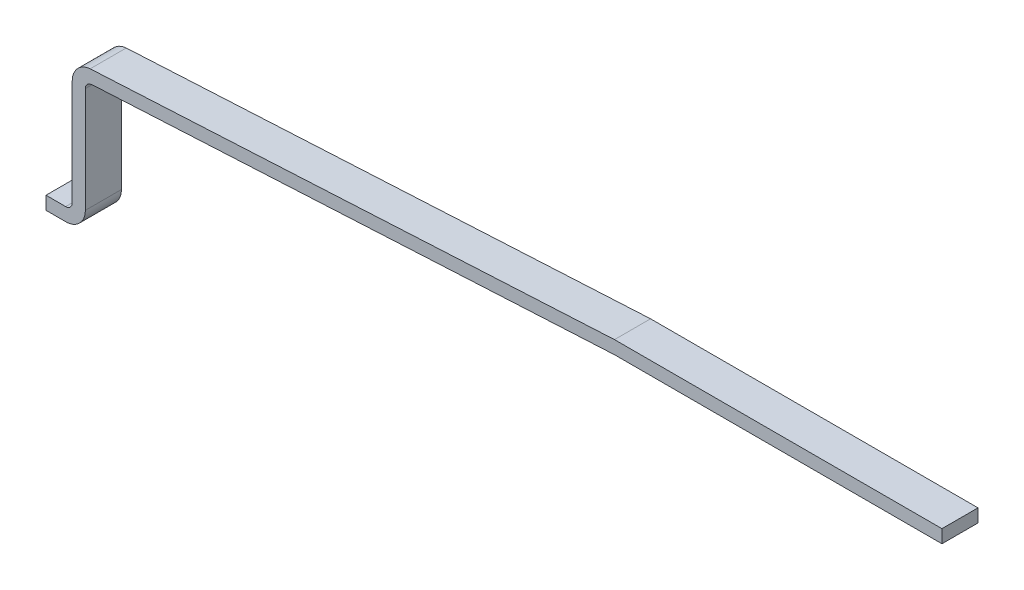
ISO-10303-21;
HEADER;
FILE_DESCRIPTION(('STEP AP214'),'2;1');
FILE_NAME('part.step','',(''),(''),'','','');
FILE_SCHEMA(('AUTOMOTIVE_DESIGN { 1 0 10303 214 1 1 1 1 }'));
ENDSEC;
DATA;
#1=APPLICATION_CONTEXT('core data for automotive mechanical design processes');
#2=APPLICATION_PROTOCOL_DEFINITION('international standard','automotive_design',2000,#1);
#3=PRODUCT_CONTEXT('',#1,'mechanical');
#4=PRODUCT('Part','Part','',(#3));
#5=PRODUCT_RELATED_PRODUCT_CATEGORY('part','',(#4));
#6=PRODUCT_DEFINITION_FORMATION('','',#4);
#7=PRODUCT_DEFINITION_CONTEXT('part definition',#1,'design');
#8=PRODUCT_DEFINITION('design','',#6,#7);
#9=PRODUCT_DEFINITION_SHAPE('','',#8);
#10=(LENGTH_UNIT() NAMED_UNIT(*) SI_UNIT(.MILLI.,.METRE.));
#11=(NAMED_UNIT(*) PLANE_ANGLE_UNIT() SI_UNIT($,.RADIAN.));
#12=(NAMED_UNIT(*) SI_UNIT($,.STERADIAN.) SOLID_ANGLE_UNIT());
#13=UNCERTAINTY_MEASURE_WITH_UNIT(LENGTH_MEASURE(1.E-05),#10,'distance_accuracy_value','');
#14=(GEOMETRIC_REPRESENTATION_CONTEXT(3) GLOBAL_UNCERTAINTY_ASSIGNED_CONTEXT((#13)) GLOBAL_UNIT_ASSIGNED_CONTEXT((#10,
#11,#12)) REPRESENTATION_CONTEXT('',''));
#15=CARTESIAN_POINT('',(0.,0.,0.));
#16=DIRECTION('',(0.,0.,1.));
#17=DIRECTION('',(1.,0.,0.));
#18=AXIS2_PLACEMENT_3D('',#15,#16,#17);
#19=CARTESIAN_POINT('',(-0.319177054542932,12.2710302640645,0.55));
#20=DIRECTION('',(1.,0.,0.));
#21=DIRECTION('',(0.,0.,-1.));
#22=AXIS2_PLACEMENT_3D('',#19,#20,#21);
#23=PLANE('',#22);
#24=DIRECTION('',(0.,-1.,0.));
#25=VECTOR('',#24,1.);
#26=CARTESIAN_POINT('',(-0.319177054542932,12.2710302640645,0.));
#27=LINE('',#26,#25);
#28=CARTESIAN_POINT('',(-0.319177054542932,12.4710302640645,0.));
#29=VERTEX_POINT('',#28);
#30=CARTESIAN_POINT('',(-0.319177054542932,12.2710302640645,0.));
#31=VERTEX_POINT('',#30);
#32=EDGE_CURVE('E170',#29,#31,#27,.T.);
#33=ORIENTED_EDGE('',*,*,#32,.T.);
#34=DIRECTION('',(0.,0.,-1.));
#35=VECTOR('',#34,1.);
#36=CARTESIAN_POINT('',(-0.319177054542932,12.2710302640645,0.55));
#37=LINE('',#36,#35);
#38=CARTESIAN_POINT('',(-0.319177054542932,12.2710302640645,0.55));
#39=VERTEX_POINT('',#38);
#40=EDGE_CURVE('E11',#39,#31,#37,.T.);
#41=ORIENTED_EDGE('',*,*,#40,.F.);
#42=DIRECTION('',(0.,-1.,0.));
#43=VECTOR('',#42,1.);
#44=CARTESIAN_POINT('',(-0.319177054542932,12.2710302640645,0.55));
#45=LINE('',#44,#43);
#46=CARTESIAN_POINT('',(-0.319177054542932,12.4710302640645,0.55));
#47=VERTEX_POINT('',#46);
#48=EDGE_CURVE('E198',#47,#39,#45,.T.);
#49=ORIENTED_EDGE('',*,*,#48,.F.);
#50=DIRECTION('',(0.,0.,-1.));
#51=VECTOR('',#50,1.);
#52=CARTESIAN_POINT('',(-0.319177054542932,12.4710302640645,0.55));
#53=LINE('',#52,#51);
#54=EDGE_CURVE('E166',#47,#29,#53,.T.);
#55=ORIENTED_EDGE('',*,*,#54,.T.);
#56=EDGE_LOOP('',(#33,#41,#49,#55));
#57=FACE_BOUND('',#56,.T.);
#58=ADVANCED_FACE('F32',(#57),#23,.F.);
#59=CARTESIAN_POINT('',(-0.0191770545429775,12.2710302640645,0.55));
#60=DIRECTION('',(0.,1.,0.));
#61=DIRECTION('',(-1.,0.,0.));
#62=AXIS2_PLACEMENT_3D('',#59,#60,#61);
#63=PLANE('',#62);
#64=DIRECTION('',(1.,0.,0.));
#65=VECTOR('',#64,1.);
#66=CARTESIAN_POINT('',(-0.0191770545429775,12.2710302640645,0.));
#67=LINE('',#66,#65);
#68=CARTESIAN_POINT('',(-0.0191770545429775,12.2710302640645,0.));
#69=VERTEX_POINT('',#68);
#70=EDGE_CURVE('E173',#31,#69,#67,.T.);
#71=ORIENTED_EDGE('',*,*,#70,.T.);
#72=DIRECTION('',(0.,0.,-1.));
#73=VECTOR('',#72,1.);
#74=CARTESIAN_POINT('',(-0.0191770545429775,12.2710302640645,0.55));
#75=LINE('',#74,#73);
#76=CARTESIAN_POINT('',(-0.0191770545429775,12.2710302640645,0.55));
#77=VERTEX_POINT('',#76);
#78=EDGE_CURVE('E40',#77,#69,#75,.T.);
#79=ORIENTED_EDGE('',*,*,#78,.F.);
#80=DIRECTION('',(1.,0.,0.));
#81=VECTOR('',#80,1.);
#82=CARTESIAN_POINT('',(-0.0191770545429775,12.2710302640645,0.55));
#83=LINE('',#82,#81);
#84=EDGE_CURVE('E112',#39,#77,#83,.T.);
#85=ORIENTED_EDGE('',*,*,#84,.F.);
#86=ORIENTED_EDGE('',*,*,#40,.T.);
#87=EDGE_LOOP('',(#71,#79,#85,#86));
#88=FACE_BOUND('',#87,.T.);
#89=ADVANCED_FACE('F291',(#88),#63,.F.);
#90=CARTESIAN_POINT('',(-0.0191770545430084,12.5710302640645,0.55));
#91=DIRECTION('',(0.,0.,-1.));
#92=DIRECTION('',(-1.,0.,0.));
#93=AXIS2_PLACEMENT_3D('',#90,#91,#92);
#94=CYLINDRICAL_SURFACE('',#93,0.300000000000008);
#95=CARTESIAN_POINT('',(-0.0191770545430084,12.5710302640645,0.));
#96=DIRECTION('',(0.,0.,1.));
#97=DIRECTION('',(1.,0.,0.));
#98=AXIS2_PLACEMENT_3D('',#95,#96,#97);
#99=CIRCLE('',#98,0.300000000000008);
#100=CARTESIAN_POINT('',(0.280822945457,12.5710302640645,0.));
#101=VERTEX_POINT('',#100);
#102=EDGE_CURVE('E175',#69,#101,#99,.T.);
#103=ORIENTED_EDGE('',*,*,#102,.T.);
#104=DIRECTION('',(0.,0.,-1.));
#105=VECTOR('',#104,1.);
#106=CARTESIAN_POINT('',(0.280822945457,12.5710302640645,0.55));
#107=LINE('',#106,#105);
#108=CARTESIAN_POINT('',(0.280822945457,12.5710302640645,0.55));
#109=VERTEX_POINT('',#108);
#110=EDGE_CURVE('E226',#109,#101,#107,.T.);
#111=ORIENTED_EDGE('',*,*,#110,.F.);
#112=CARTESIAN_POINT('',(-0.0191770545430084,12.5710302640645,0.55));
#113=DIRECTION('',(0.,0.,1.));
#114=DIRECTION('',(1.,0.,0.));
#115=AXIS2_PLACEMENT_3D('',#112,#113,#114);
#116=CIRCLE('',#115,0.300000000000008);
#117=EDGE_CURVE('E234',#77,#109,#116,.T.);
#118=ORIENTED_EDGE('',*,*,#117,.F.);
#119=ORIENTED_EDGE('',*,*,#78,.T.);
#120=EDGE_LOOP('',(#103,#111,#118,#119));
#121=FACE_BOUND('',#120,.T.);
#122=ADVANCED_FACE('F232',(#121),#94,.T.);
#123=CARTESIAN_POINT('',(0.280822945456877,14.1793971466627,0.55));
#124=DIRECTION('',(-1.,0.,0.));
#125=DIRECTION('',(0.,-1.,0.));
#126=AXIS2_PLACEMENT_3D('',#123,#124,#125);
#127=PLANE('',#126);
#128=DIRECTION('',(0.,1.,0.));
#129=VECTOR('',#128,1.);
#130=CARTESIAN_POINT('',(0.280822945456877,14.1793971466627,0.));
#131=LINE('',#130,#129);
#132=CARTESIAN_POINT('',(0.280822945456878,14.1793971466627,0.));
#133=VERTEX_POINT('',#132);
#134=EDGE_CURVE('E177',#101,#133,#131,.T.);
#135=ORIENTED_EDGE('',*,*,#134,.T.);
#136=DIRECTION('',(0.,0.,-1.));
#137=VECTOR('',#136,1.);
#138=CARTESIAN_POINT('',(0.280822945456878,14.1793971466627,0.55));
#139=LINE('',#138,#137);
#140=CARTESIAN_POINT('',(0.280822945456878,14.1793971466627,0.55));
#141=VERTEX_POINT('',#140);
#142=EDGE_CURVE('E223',#141,#133,#139,.T.);
#143=ORIENTED_EDGE('',*,*,#142,.F.);
#144=DIRECTION('',(0.,1.,0.));
#145=VECTOR('',#144,1.);
#146=CARTESIAN_POINT('',(0.280822945456877,14.1793971466627,0.55));
#147=LINE('',#146,#145);
#148=EDGE_CURVE('E252',#109,#141,#147,.T.);
#149=ORIENTED_EDGE('',*,*,#148,.F.);
#150=ORIENTED_EDGE('',*,*,#110,.T.);
#151=EDGE_LOOP('',(#135,#143,#149,#150));
#152=FACE_BOUND('',#151,.T.);
#153=ADVANCED_FACE('F243',(#152),#127,.F.);
#154=CARTESIAN_POINT('',(0.380822945456872,14.1793971466627,0.55));
#155=DIRECTION('',(0.,0.,-1.));
#156=DIRECTION('',(-1.,0.,0.));
#157=AXIS2_PLACEMENT_3D('',#154,#155,#156);
#158=CYLINDRICAL_SURFACE('',#157,0.0999999999999945);
#159=CARTESIAN_POINT('',(0.380822945456872,14.1793971466627,0.));
#160=DIRECTION('',(0.,0.,-1.));
#161=DIRECTION('',(-1.,0.,0.));
#162=AXIS2_PLACEMENT_3D('',#159,#160,#161);
#163=CIRCLE('',#162,0.0999999999999945);
#164=CARTESIAN_POINT('',(0.372107371182212,14.2790166164719,0.));
#165=VERTEX_POINT('',#164);
#166=EDGE_CURVE('E179',#133,#165,#163,.T.);
#167=ORIENTED_EDGE('',*,*,#166,.T.);
#168=DIRECTION('',(0.,0.,-1.));
#169=VECTOR('',#168,1.);
#170=CARTESIAN_POINT('',(0.372107371182212,14.2790166164719,0.55));
#171=LINE('',#170,#169);
#172=CARTESIAN_POINT('',(0.372107371182212,14.2790166164719,0.55));
#173=VERTEX_POINT('',#172);
#174=EDGE_CURVE('E220',#173,#165,#171,.T.);
#175=ORIENTED_EDGE('',*,*,#174,.F.);
#176=CARTESIAN_POINT('',(0.380822945456872,14.1793971466627,0.55));
#177=DIRECTION('',(0.,0.,-1.));
#178=DIRECTION('',(-1.,0.,0.));
#179=AXIS2_PLACEMENT_3D('',#176,#177,#178);
#180=CIRCLE('',#179,0.0999999999999945);
#181=EDGE_CURVE('E249',#141,#173,#180,.T.);
#182=ORIENTED_EDGE('',*,*,#181,.F.);
#183=ORIENTED_EDGE('',*,*,#142,.T.);
#184=EDGE_LOOP('',(#167,#175,#182,#183));
#185=FACE_BOUND('',#184,.T.);
#186=ADVANCED_FACE('F247',(#185),#158,.F.);
#187=CARTESIAN_POINT('',(0.432418849359921,14.2850571546016,0.55));
#188=DIRECTION('',(-0.099657105804021,0.995021839590853,0.));
#189=DIRECTION('',(-0.995021839590854,-0.099657105804021,0.));
#190=AXIS2_PLACEMENT_3D('',#187,#188,#189);
#191=PLANE('',#190);
#192=DIRECTION('',(0.995021839590854,0.099657105804021,0.));
#193=VECTOR('',#192,1.);
#194=CARTESIAN_POINT('',(0.432418849359921,14.2850571546016,0.));
#195=LINE('',#194,#193);
#196=CARTESIAN_POINT('',(0.432418849359921,14.2850571546016,0.));
#197=VERTEX_POINT('',#196);
#198=EDGE_CURVE('E181',#165,#197,#195,.T.);
#199=ORIENTED_EDGE('',*,*,#198,.T.);
#200=DIRECTION('',(0.,0.,-1.));
#201=VECTOR('',#200,1.);
#202=CARTESIAN_POINT('',(0.432418849359921,14.2850571546016,0.55));
#203=LINE('',#202,#201);
#204=CARTESIAN_POINT('',(0.432418849359921,14.2850571546016,0.55));
#205=VERTEX_POINT('',#204);
#206=EDGE_CURVE('E217',#205,#197,#203,.T.);
#207=ORIENTED_EDGE('',*,*,#206,.F.);
#208=DIRECTION('',(0.995021839590854,0.099657105804021,0.));
#209=VECTOR('',#208,1.);
#210=CARTESIAN_POINT('',(0.432418849359921,14.2850571546016,0.55));
#211=LINE('',#210,#209);
#212=EDGE_CURVE('E251',#173,#205,#211,.T.);
#213=ORIENTED_EDGE('',*,*,#212,.F.);
#214=ORIENTED_EDGE('',*,*,#174,.T.);
#215=EDGE_LOOP('',(#199,#207,#213,#214));
#216=FACE_BOUND('',#215,.T.);
#217=ADVANCED_FACE('F304',(#216),#191,.F.);
#218=CARTESIAN_POINT('',(8.35436609429098,14.7,0.55));
#219=DIRECTION('',(-0.0523071907961511,0.99863104187233,0.));
#220=DIRECTION('',(-0.99863104187233,-0.0523071907961511,0.));
#221=AXIS2_PLACEMENT_3D('',#218,#219,#220);
#222=PLANE('',#221);
#223=DIRECTION('',(0.99863104187233,0.0523071907961511,0.));
#224=VECTOR('',#223,1.);
#225=CARTESIAN_POINT('',(8.35436609429098,14.7,0.));
#226=LINE('',#225,#224);
#227=CARTESIAN_POINT('',(8.35436609429098,14.7,0.));
#228=VERTEX_POINT('',#227);
#229=EDGE_CURVE('E183',#197,#228,#226,.T.);
#230=ORIENTED_EDGE('',*,*,#229,.T.);
#231=DIRECTION('',(0.,0.,-1.));
#232=VECTOR('',#231,1.);
#233=CARTESIAN_POINT('',(8.35436609429098,14.7,0.55));
#234=LINE('',#233,#232);
#235=CARTESIAN_POINT('',(8.35436609429098,14.7,0.55));
#236=VERTEX_POINT('',#235);
#237=EDGE_CURVE('E214',#236,#228,#234,.T.);
#238=ORIENTED_EDGE('',*,*,#237,.F.);
#239=DIRECTION('',(0.99863104187233,0.0523071907961511,0.));
#240=VECTOR('',#239,1.);
#241=CARTESIAN_POINT('',(8.35436609429098,14.7,0.55));
#242=LINE('',#241,#240);
#243=EDGE_CURVE('E254',#205,#236,#242,.T.);
#244=ORIENTED_EDGE('',*,*,#243,.F.);
#245=ORIENTED_EDGE('',*,*,#206,.T.);
#246=EDGE_LOOP('',(#230,#238,#244,#245));
#247=FACE_BOUND('',#246,.T.);
#248=ADVANCED_FACE('F307',(#247),#222,.F.);
#249=CARTESIAN_POINT('',(13.3500000000001,14.6999999999999,0.55));
#250=DIRECTION('',(0.,1.,0.));
#251=DIRECTION('',(-1.,0.,0.));
#252=AXIS2_PLACEMENT_3D('',#249,#250,#251);
#253=PLANE('',#252);
#254=DIRECTION('',(1.,0.,0.));
#255=VECTOR('',#254,1.);
#256=CARTESIAN_POINT('',(13.3500000000001,14.6999999999999,0.));
#257=LINE('',#256,#255);
#258=CARTESIAN_POINT('',(13.3500000000001,14.6999999999999,0.));
#259=VERTEX_POINT('',#258);
#260=EDGE_CURVE('E185',#228,#259,#257,.T.);
#261=ORIENTED_EDGE('',*,*,#260,.T.);
#262=DIRECTION('',(0.,0.,-1.));
#263=VECTOR('',#262,1.);
#264=CARTESIAN_POINT('',(13.3500000000001,14.6999999999999,0.55));
#265=LINE('',#264,#263);
#266=CARTESIAN_POINT('',(13.3500000000001,14.6999999999999,0.55));
#267=VERTEX_POINT('',#266);
#268=EDGE_CURVE('E211',#267,#259,#265,.T.);
#269=ORIENTED_EDGE('',*,*,#268,.F.);
#270=DIRECTION('',(1.,0.,0.));
#271=VECTOR('',#270,1.);
#272=CARTESIAN_POINT('',(13.3500000000001,14.6999999999999,0.55));
#273=LINE('',#272,#271);
#274=EDGE_CURVE('E260',#236,#267,#273,.T.);
#275=ORIENTED_EDGE('',*,*,#274,.F.);
#276=ORIENTED_EDGE('',*,*,#237,.T.);
#277=EDGE_LOOP('',(#261,#269,#275,#276));
#278=FACE_BOUND('',#277,.T.);
#279=ADVANCED_FACE('F311',(#278),#253,.F.);
#280=CARTESIAN_POINT('',(13.3500000000001,14.9,0.55));
#281=DIRECTION('',(-1.,0.,0.));
#282=DIRECTION('',(0.,0.,1.));
#283=AXIS2_PLACEMENT_3D('',#280,#281,#282);
#284=PLANE('',#283);
#285=DIRECTION('',(0.,1.,0.));
#286=VECTOR('',#285,1.);
#287=CARTESIAN_POINT('',(13.3500000000001,14.9,0.));
#288=LINE('',#287,#286);
#289=CARTESIAN_POINT('',(13.3500000000001,14.9,0.));
#290=VERTEX_POINT('',#289);
#291=EDGE_CURVE('E187',#259,#290,#288,.T.);
#292=ORIENTED_EDGE('',*,*,#291,.T.);
#293=DIRECTION('',(0.,0.,-1.));
#294=VECTOR('',#293,1.);
#295=CARTESIAN_POINT('',(13.3500000000001,14.9,0.55));
#296=LINE('',#295,#294);
#297=CARTESIAN_POINT('',(13.3500000000001,14.9,0.55));
#298=VERTEX_POINT('',#297);
#299=EDGE_CURVE('E208',#298,#290,#296,.T.);
#300=ORIENTED_EDGE('',*,*,#299,.F.);
#301=DIRECTION('',(0.,1.,0.));
#302=VECTOR('',#301,1.);
#303=CARTESIAN_POINT('',(13.3500000000001,14.9,0.55));
#304=LINE('',#303,#302);
#305=EDGE_CURVE('E262',#267,#298,#304,.T.);
#306=ORIENTED_EDGE('',*,*,#305,.F.);
#307=ORIENTED_EDGE('',*,*,#268,.T.);
#308=EDGE_LOOP('',(#292,#300,#306,#307));
#309=FACE_BOUND('',#308,.T.);
#310=ADVANCED_FACE('F315',(#309),#284,.F.);
#311=CARTESIAN_POINT('',(8.35436609429098,14.9,0.55));
#312=DIRECTION('',(0.,-1.,0.));
#313=DIRECTION('',(0.,0.,-1.));
#314=AXIS2_PLACEMENT_3D('',#311,#312,#313);
#315=PLANE('',#314);
#316=DIRECTION('',(-1.,0.,0.));
#317=VECTOR('',#316,1.);
#318=CARTESIAN_POINT('',(8.35436609429098,14.9,0.));
#319=LINE('',#318,#317);
#320=CARTESIAN_POINT('',(8.35436609429098,14.9,0.));
#321=VERTEX_POINT('',#320);
#322=EDGE_CURVE('E189',#290,#321,#319,.T.);
#323=ORIENTED_EDGE('',*,*,#322,.T.);
#324=DIRECTION('',(0.,0.,-1.));
#325=VECTOR('',#324,1.);
#326=CARTESIAN_POINT('',(8.35436609429098,14.9,0.55));
#327=LINE('',#326,#325);
#328=CARTESIAN_POINT('',(8.35436609429098,14.9,0.55));
#329=VERTEX_POINT('',#328);
#330=EDGE_CURVE('E205',#329,#321,#327,.T.);
#331=ORIENTED_EDGE('',*,*,#330,.F.);
#332=DIRECTION('',(-1.,0.,0.));
#333=VECTOR('',#332,1.);
#334=CARTESIAN_POINT('',(8.35436609429098,14.9,0.55));
#335=LINE('',#334,#333);
#336=EDGE_CURVE('E264',#298,#329,#335,.T.);
#337=ORIENTED_EDGE('',*,*,#336,.F.);
#338=ORIENTED_EDGE('',*,*,#299,.T.);
#339=EDGE_LOOP('',(#323,#331,#337,#338));
#340=FACE_BOUND('',#339,.T.);
#341=ADVANCED_FACE('F319',(#340),#315,.F.);
#342=CARTESIAN_POINT('',(0.354676222632635,14.4782555560903,0.55));
#343=DIRECTION('',(0.0526469862556797,-0.998613185792274,0.));
#344=DIRECTION('',(0.998613185792274,0.0526469862556797,0.));
#345=AXIS2_PLACEMENT_3D('',#342,#343,#344);
#346=PLANE('',#345);
#347=DIRECTION('',(-0.998613185792274,-0.0526469862556797,0.));
#348=VECTOR('',#347,1.);
#349=CARTESIAN_POINT('',(0.354676222632635,14.4782555560903,0.));
#350=LINE('',#349,#348);
#351=CARTESIAN_POINT('',(0.354676222632635,14.4782555560903,0.));
#352=VERTEX_POINT('',#351);
#353=EDGE_CURVE('E191',#321,#352,#350,.T.);
#354=ORIENTED_EDGE('',*,*,#353,.T.);
#355=DIRECTION('',(0.,0.,-1.));
#356=VECTOR('',#355,1.);
#357=CARTESIAN_POINT('',(0.354676222632635,14.4782555560903,0.55));
#358=LINE('',#357,#356);
#359=CARTESIAN_POINT('',(0.354676222632635,14.4782555560903,0.55));
#360=VERTEX_POINT('',#359);
#361=EDGE_CURVE('E202',#360,#352,#358,.T.);
#362=ORIENTED_EDGE('',*,*,#361,.F.);
#363=DIRECTION('',(-0.998613185792274,-0.0526469862556797,0.));
#364=VECTOR('',#363,1.);
#365=CARTESIAN_POINT('',(0.354676222632635,14.4782555560903,0.55));
#366=LINE('',#365,#364);
#367=EDGE_CURVE('E266',#329,#360,#366,.T.);
#368=ORIENTED_EDGE('',*,*,#367,.F.);
#369=ORIENTED_EDGE('',*,*,#330,.T.);
#370=EDGE_LOOP('',(#354,#362,#368,#369));
#371=FACE_BOUND('',#370,.T.);
#372=ADVANCED_FACE('F272',(#371),#346,.F.);
#373=CARTESIAN_POINT('',(0.380822945456916,14.1793971466627,0.55));
#374=DIRECTION('',(0.,0.,-1.));
#375=DIRECTION('',(-1.,0.,0.));
#376=AXIS2_PLACEMENT_3D('',#373,#374,#375);
#377=CYLINDRICAL_SURFACE('',#376,0.300000000000013);
#378=CARTESIAN_POINT('',(0.380822945456916,14.1793971466627,0.));
#379=DIRECTION('',(0.,0.,1.));
#380=DIRECTION('',(1.,0.,0.));
#381=AXIS2_PLACEMENT_3D('',#378,#379,#380);
#382=CIRCLE('',#381,0.300000000000013);
#383=CARTESIAN_POINT('',(0.0808229454569033,14.1793971466627,0.));
#384=VERTEX_POINT('',#383);
#385=EDGE_CURVE('E193',#352,#384,#382,.T.);
#386=ORIENTED_EDGE('',*,*,#385,.T.);
#387=DIRECTION('',(0.,0.,-1.));
#388=VECTOR('',#387,1.);
#389=CARTESIAN_POINT('',(0.0808229454569033,14.1793971466627,0.55));
#390=LINE('',#389,#388);
#391=CARTESIAN_POINT('',(0.0808229454569033,14.1793971466627,0.55));
#392=VERTEX_POINT('',#391);
#393=EDGE_CURVE('E161',#392,#384,#390,.T.);
#394=ORIENTED_EDGE('',*,*,#393,.F.);
#395=CARTESIAN_POINT('',(0.380822945456916,14.1793971466627,0.55));
#396=DIRECTION('',(0.,0.,1.));
#397=DIRECTION('',(1.,0.,0.));
#398=AXIS2_PLACEMENT_3D('',#395,#396,#397);
#399=CIRCLE('',#398,0.300000000000013);
#400=EDGE_CURVE('E152',#360,#392,#399,.T.);
#401=ORIENTED_EDGE('',*,*,#400,.F.);
#402=ORIENTED_EDGE('',*,*,#361,.T.);
#403=EDGE_LOOP('',(#386,#394,#401,#402));
#404=FACE_BOUND('',#403,.T.);
#405=ADVANCED_FACE('F276',(#404),#377,.T.);
#406=CARTESIAN_POINT('',(0.0808229454569316,12.5710302640645,0.55));
#407=DIRECTION('',(1.,0.,0.));
#408=DIRECTION('',(0.,1.,0.));
#409=AXIS2_PLACEMENT_3D('',#406,#407,#408);
#410=PLANE('',#409);
#411=DIRECTION('',(0.,-1.,0.));
#412=VECTOR('',#411,1.);
#413=CARTESIAN_POINT('',(0.0808229454569316,12.5710302640645,0.));
#414=LINE('',#413,#412);
#415=CARTESIAN_POINT('',(0.0808229454569316,12.5710302640645,0.));
#416=VERTEX_POINT('',#415);
#417=EDGE_CURVE('E160',#384,#416,#414,.T.);
#418=ORIENTED_EDGE('',*,*,#417,.T.);
#419=DIRECTION('',(0.,0.,-1.));
#420=VECTOR('',#419,1.);
#421=CARTESIAN_POINT('',(0.0808229454569316,12.5710302640645,0.55));
#422=LINE('',#421,#420);
#423=CARTESIAN_POINT('',(0.0808229454569316,12.5710302640645,0.55));
#424=VERTEX_POINT('',#423);
#425=EDGE_CURVE('E157',#424,#416,#422,.T.);
#426=ORIENTED_EDGE('',*,*,#425,.F.);
#427=DIRECTION('',(0.,-1.,0.));
#428=VECTOR('',#427,1.);
#429=CARTESIAN_POINT('',(0.0808229454569316,12.5710302640645,0.55));
#430=LINE('',#429,#428);
#431=EDGE_CURVE('E146',#392,#424,#430,.T.);
#432=ORIENTED_EDGE('',*,*,#431,.F.);
#433=ORIENTED_EDGE('',*,*,#393,.T.);
#434=EDGE_LOOP('',(#418,#426,#432,#433));
#435=FACE_BOUND('',#434,.T.);
#436=ADVANCED_FACE('F158',(#435),#410,.F.);
#437=CARTESIAN_POINT('',(-0.0191770545430678,12.5710302640645,0.55));
#438=DIRECTION('',(0.,0.,-1.));
#439=DIRECTION('',(-1.,0.,0.));
#440=AXIS2_PLACEMENT_3D('',#437,#438,#439);
#441=CYLINDRICAL_SURFACE('',#440,0.0999999999999994);
#442=CARTESIAN_POINT('',(-0.0191770545430678,12.5710302640645,0.));
#443=DIRECTION('',(0.,0.,-1.));
#444=DIRECTION('',(1.,0.,0.));
#445=AXIS2_PLACEMENT_3D('',#442,#443,#444);
#446=CIRCLE('',#445,0.0999999999999994);
#447=CARTESIAN_POINT('',(-0.0191770545429775,12.4710302640645,0.));
#448=VERTEX_POINT('',#447);
#449=EDGE_CURVE('E98',#416,#448,#446,.T.);
#450=ORIENTED_EDGE('',*,*,#449,.T.);
#451=DIRECTION('',(0.,0.,-1.));
#452=VECTOR('',#451,1.);
#453=CARTESIAN_POINT('',(-0.0191770545429775,12.4710302640645,0.55));
#454=LINE('',#453,#452);
#455=CARTESIAN_POINT('',(-0.0191770545429775,12.4710302640645,0.55));
#456=VERTEX_POINT('',#455);
#457=EDGE_CURVE('E162',#456,#448,#454,.T.);
#458=ORIENTED_EDGE('',*,*,#457,.F.);
#459=CARTESIAN_POINT('',(-0.0191770545430678,12.5710302640645,0.55));
#460=DIRECTION('',(0.,0.,-1.));
#461=DIRECTION('',(1.,0.,0.));
#462=AXIS2_PLACEMENT_3D('',#459,#460,#461);
#463=CIRCLE('',#462,0.0999999999999994);
#464=EDGE_CURVE('E150',#424,#456,#463,.T.);
#465=ORIENTED_EDGE('',*,*,#464,.F.);
#466=ORIENTED_EDGE('',*,*,#425,.T.);
#467=EDGE_LOOP('',(#450,#458,#465,#466));
#468=FACE_BOUND('',#467,.T.);
#469=ADVANCED_FACE('F164',(#468),#441,.F.);
#470=CARTESIAN_POINT('',(-0.319177054542932,12.4710302640645,0.55));
#471=DIRECTION('',(0.,-1.,0.));
#472=DIRECTION('',(0.,0.,-1.));
#473=AXIS2_PLACEMENT_3D('',#470,#471,#472);
#474=PLANE('',#473);
#475=DIRECTION('',(-1.,0.,0.));
#476=VECTOR('',#475,1.);
#477=CARTESIAN_POINT('',(-0.319177054542932,12.4710302640645,0.));
#478=LINE('',#477,#476);
#479=EDGE_CURVE('E104',#448,#29,#478,.T.);
#480=ORIENTED_EDGE('',*,*,#479,.T.);
#481=ORIENTED_EDGE('',*,*,#54,.F.);
#482=DIRECTION('',(-1.,0.,0.));
#483=VECTOR('',#482,1.);
#484=CARTESIAN_POINT('',(-0.319177054542932,12.4710302640645,0.55));
#485=LINE('',#484,#483);
#486=EDGE_CURVE('E48',#456,#47,#485,.T.);
#487=ORIENTED_EDGE('',*,*,#486,.F.);
#488=ORIENTED_EDGE('',*,*,#457,.T.);
#489=EDGE_LOOP('',(#480,#481,#487,#488));
#490=FACE_BOUND('',#489,.T.);
#491=ADVANCED_FACE('F280',(#490),#474,.F.);
#492=CARTESIAN_POINT('',(-0.0191770545430678,12.5710302640645,0.55));
#493=DIRECTION('',(0.,0.,1.));
#494=DIRECTION('',(1.,0.,0.));
#495=AXIS2_PLACEMENT_3D('',#492,#493,#494);
#496=PLANE('',#495);
#497=ORIENTED_EDGE('',*,*,#48,.T.);
#498=ORIENTED_EDGE('',*,*,#84,.T.);
#499=ORIENTED_EDGE('',*,*,#117,.T.);
#500=ORIENTED_EDGE('',*,*,#148,.T.);
#501=ORIENTED_EDGE('',*,*,#181,.T.);
#502=ORIENTED_EDGE('',*,*,#212,.T.);
#503=ORIENTED_EDGE('',*,*,#243,.T.);
#504=ORIENTED_EDGE('',*,*,#274,.T.);
#505=ORIENTED_EDGE('',*,*,#305,.T.);
#506=ORIENTED_EDGE('',*,*,#336,.T.);
#507=ORIENTED_EDGE('',*,*,#367,.T.);
#508=ORIENTED_EDGE('',*,*,#400,.T.);
#509=ORIENTED_EDGE('',*,*,#431,.T.);
#510=ORIENTED_EDGE('',*,*,#464,.T.);
#511=ORIENTED_EDGE('',*,*,#486,.T.);
#512=EDGE_LOOP('',(#497,#498,#499,#500,#501,#502,#503,#504,#505,#506,#507,#508,#509,#510,#511));
#513=FACE_BOUND('',#512,.T.);
#514=ADVANCED_FACE('F148',(#513),#496,.T.);
#515=CARTESIAN_POINT('',(-0.0191770545430678,12.5710302640645,0.));
#516=DIRECTION('',(0.,0.,1.));
#517=DIRECTION('',(1.,0.,0.));
#518=AXIS2_PLACEMENT_3D('',#515,#516,#517);
#519=PLANE('',#518);
#520=ORIENTED_EDGE('',*,*,#32,.F.);
#521=ORIENTED_EDGE('',*,*,#479,.F.);
#522=ORIENTED_EDGE('',*,*,#449,.F.);
#523=ORIENTED_EDGE('',*,*,#417,.F.);
#524=ORIENTED_EDGE('',*,*,#385,.F.);
#525=ORIENTED_EDGE('',*,*,#353,.F.);
#526=ORIENTED_EDGE('',*,*,#322,.F.);
#527=ORIENTED_EDGE('',*,*,#291,.F.);
#528=ORIENTED_EDGE('',*,*,#260,.F.);
#529=ORIENTED_EDGE('',*,*,#229,.F.);
#530=ORIENTED_EDGE('',*,*,#198,.F.);
#531=ORIENTED_EDGE('',*,*,#166,.F.);
#532=ORIENTED_EDGE('',*,*,#134,.F.);
#533=ORIENTED_EDGE('',*,*,#102,.F.);
#534=ORIENTED_EDGE('',*,*,#70,.F.);
#535=EDGE_LOOP('',(#520,#521,#522,#523,#524,#525,#526,#527,#528,#529,#530,#531,#532,#533,#534));
#536=FACE_BOUND('',#535,.T.);
#537=ADVANCED_FACE('F238',(#536),#519,.F.);
#538=CLOSED_SHELL('',(#58,#89,#122,#153,#186,#217,#248,#279,#310,#341,#372,#405,#436,#469,#491,
#514,#537));
#539=MANIFOLD_SOLID_BREP('B2',#538);
#540=ADVANCED_BREP_SHAPE_REPRESENTATION('',(#18,#539),#14);
#541=SHAPE_DEFINITION_REPRESENTATION(#9,#540);
ENDSEC;
END-ISO-10303-21;
